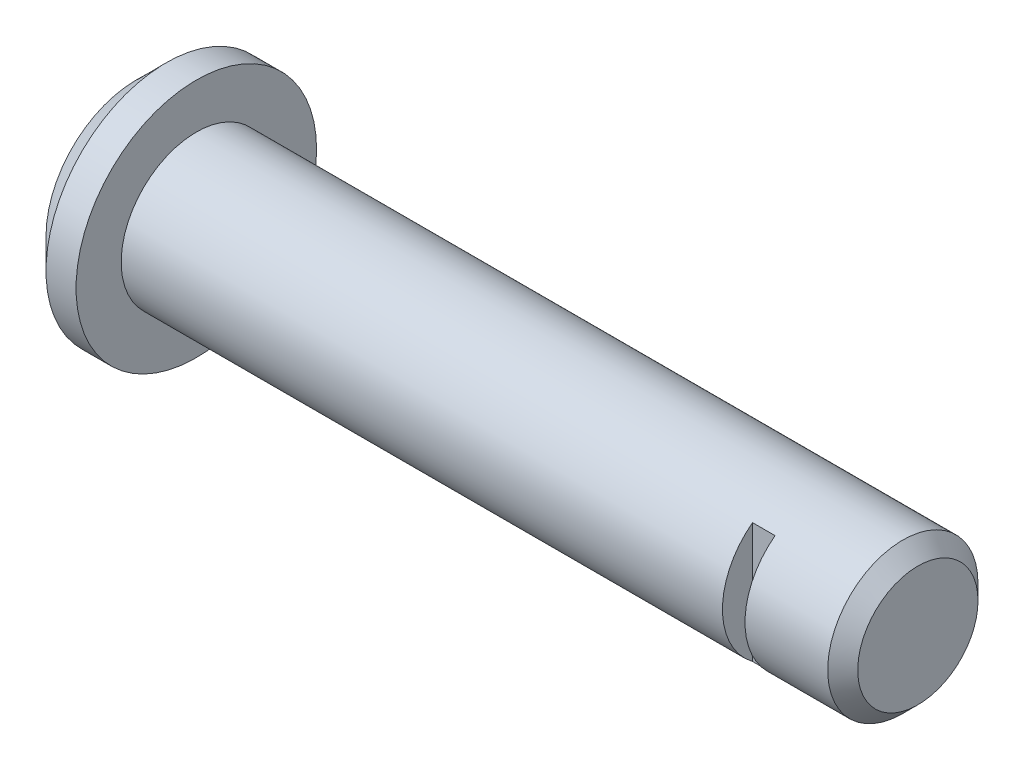
ISO-10303-21;
HEADER;
FILE_DESCRIPTION(('STEP AP214'),'2;1');
FILE_NAME('part.step','',(''),(''),'','','');
FILE_SCHEMA(('AUTOMOTIVE_DESIGN { 1 0 10303 214 1 1 1 1 }'));
ENDSEC;
DATA;
#1=APPLICATION_CONTEXT('core data for automotive mechanical design processes');
#2=APPLICATION_PROTOCOL_DEFINITION('international standard','automotive_design',2000,#1);
#3=PRODUCT_CONTEXT('',#1,'mechanical');
#4=PRODUCT('Part','Part','',(#3));
#5=PRODUCT_RELATED_PRODUCT_CATEGORY('part','',(#4));
#6=PRODUCT_DEFINITION_FORMATION('','',#4);
#7=PRODUCT_DEFINITION_CONTEXT('part definition',#1,'design');
#8=PRODUCT_DEFINITION('design','',#6,#7);
#9=PRODUCT_DEFINITION_SHAPE('','',#8);
#10=(LENGTH_UNIT() NAMED_UNIT(*) SI_UNIT(.MILLI.,.METRE.));
#11=(NAMED_UNIT(*) PLANE_ANGLE_UNIT() SI_UNIT($,.RADIAN.));
#12=(NAMED_UNIT(*) SI_UNIT($,.STERADIAN.) SOLID_ANGLE_UNIT());
#13=UNCERTAINTY_MEASURE_WITH_UNIT(LENGTH_MEASURE(1.E-05),#10,'distance_accuracy_value','');
#14=(GEOMETRIC_REPRESENTATION_CONTEXT(3) GLOBAL_UNCERTAINTY_ASSIGNED_CONTEXT((#13)) GLOBAL_UNIT_ASSIGNED_CONTEXT((#10,
#11,#12)) REPRESENTATION_CONTEXT('',''));
#15=CARTESIAN_POINT('',(0.,0.,0.));
#16=DIRECTION('',(0.,0.,1.));
#17=DIRECTION('',(1.,0.,0.));
#18=AXIS2_PLACEMENT_3D('',#15,#16,#17);
#19=CARTESIAN_POINT('',(0.,0.,0.));
#20=DIRECTION('',(-1.,0.,0.));
#21=DIRECTION('',(0.,0.,1.));
#22=AXIS2_PLACEMENT_3D('',#19,#20,#21);
#23=PLANE('',#22);
#24=CARTESIAN_POINT('',(0.,0.,-9.99999999999999));
#25=DIRECTION('',(1.,0.,0.));
#26=DIRECTION('',(0.,0.,-1.));
#27=AXIS2_PLACEMENT_3D('',#24,#25,#26);
#28=CIRCLE('',#27,9.99999999999999);
#29=CARTESIAN_POINT('',(0.,0.,-20.));
#30=VERTEX_POINT('',#29);
#31=EDGE_CURVE('E104',#30,#30,#28,.T.);
#32=ORIENTED_EDGE('',*,*,#31,.F.);
#33=EDGE_LOOP('',(#32));
#34=FACE_BOUND('',#33,.T.);
#35=CARTESIAN_POINT('',(0.,0.,-9.99999999999999));
#36=DIRECTION('',(1.,0.,0.));
#37=DIRECTION('',(0.,0.,-1.));
#38=AXIS2_PLACEMENT_3D('',#35,#36,#37);
#39=CIRCLE('',#38,16.);
#40=CARTESIAN_POINT('',(0.,0.,-26.));
#41=VERTEX_POINT('',#40);
#42=EDGE_CURVE('E70',#41,#41,#39,.T.);
#43=ORIENTED_EDGE('',*,*,#42,.T.);
#44=EDGE_LOOP('',(#43));
#45=FACE_BOUND('',#44,.T.);
#46=ADVANCED_FACE('F38',(#34,#45),#23,.F.);
#47=CARTESIAN_POINT('',(67.877257864528,0.,-10.));
#48=DIRECTION('',(1.,0.,0.));
#49=DIRECTION('',(0.,0.,-1.));
#50=AXIS2_PLACEMENT_3D('',#47,#48,#49);
#51=CYLINDRICAL_SURFACE('',#50,16.);
#52=ORIENTED_EDGE('',*,*,#42,.F.);
#53=EDGE_LOOP('',(#52));
#54=FACE_BOUND('',#53,.T.);
#55=CARTESIAN_POINT('',(-4.,0.,-9.99999999999999));
#56=DIRECTION('',(1.,0.,0.));
#57=DIRECTION('',(0.,0.,-1.));
#58=AXIS2_PLACEMENT_3D('',#55,#56,#57);
#59=CIRCLE('',#58,16.);
#60=CARTESIAN_POINT('',(-4.00000000000001,0.,-26.));
#61=VERTEX_POINT('',#60);
#62=EDGE_CURVE('E88',#61,#61,#59,.T.);
#63=ORIENTED_EDGE('',*,*,#62,.T.);
#64=EDGE_LOOP('',(#63));
#65=FACE_BOUND('',#64,.T.);
#66=ADVANCED_FACE('F121',(#54,#65),#51,.T.);
#67=CARTESIAN_POINT('',(-7.99999999999999,0.,-9.99999999999999));
#68=DIRECTION('',(1.,0.,0.));
#69=DIRECTION('',(0.,0.,-1.));
#70=AXIS2_PLACEMENT_3D('',#67,#68,#69);
#71=CONICAL_SURFACE('',#70,12.,0.785398163397448);
#72=ORIENTED_EDGE('',*,*,#62,.F.);
#73=EDGE_LOOP('',(#72));
#74=FACE_BOUND('',#73,.T.);
#75=CARTESIAN_POINT('',(-7.99999999999999,0.,-9.99999999999999));
#76=DIRECTION('',(1.,0.,0.));
#77=DIRECTION('',(0.,0.,-1.));
#78=AXIS2_PLACEMENT_3D('',#75,#76,#77);
#79=CIRCLE('',#78,12.);
#80=CARTESIAN_POINT('',(-7.99999999999999,0.,-22.));
#81=VERTEX_POINT('',#80);
#82=EDGE_CURVE('E92',#81,#81,#79,.T.);
#83=ORIENTED_EDGE('',*,*,#82,.T.);
#84=EDGE_LOOP('',(#83));
#85=FACE_BOUND('',#84,.T.);
#86=ADVANCED_FACE('F126',(#74,#85),#71,.T.);
#87=CARTESIAN_POINT('',(-8.,0.,2.00000000000002));
#88=DIRECTION('',(1.,0.,0.));
#89=DIRECTION('',(0.,0.,-1.));
#90=AXIS2_PLACEMENT_3D('',#87,#88,#89);
#91=PLANE('',#90);
#92=ORIENTED_EDGE('',*,*,#82,.F.);
#93=EDGE_LOOP('',(#92));
#94=FACE_BOUND('',#93,.T.);
#95=ADVANCED_FACE('F136',(#94),#91,.F.);
#96=CARTESIAN_POINT('',(96.,0.,-2.));
#97=DIRECTION('',(-1.,0.,0.));
#98=DIRECTION('',(0.,0.,1.));
#99=AXIS2_PLACEMENT_3D('',#96,#97,#98);
#100=PLANE('',#99);
#101=CARTESIAN_POINT('',(96.,0.,-10.));
#102=DIRECTION('',(1.,0.,0.));
#103=DIRECTION('',(0.,0.,-1.));
#104=AXIS2_PLACEMENT_3D('',#101,#102,#103);
#105=CIRCLE('',#104,8.00000000000001);
#106=CARTESIAN_POINT('',(96.,0.,-18.));
#107=VERTEX_POINT('',#106);
#108=EDGE_CURVE('E96',#107,#107,#105,.T.);
#109=ORIENTED_EDGE('',*,*,#108,.T.);
#110=EDGE_LOOP('',(#109));
#111=FACE_BOUND('',#110,.T.);
#112=ADVANCED_FACE('F141',(#111),#100,.F.);
#113=CARTESIAN_POINT('',(94.,0.,-10.));
#114=DIRECTION('',(-1.,0.,0.));
#115=DIRECTION('',(0.,0.,1.));
#116=AXIS2_PLACEMENT_3D('',#113,#114,#115);
#117=CONICAL_SURFACE('',#116,10.,0.785398163397447);
#118=ORIENTED_EDGE('',*,*,#108,.F.);
#119=EDGE_LOOP('',(#118));
#120=FACE_BOUND('',#119,.T.);
#121=CARTESIAN_POINT('',(94.,0.,-10.));
#122=DIRECTION('',(1.,0.,0.));
#123=DIRECTION('',(0.,0.,-1.));
#124=AXIS2_PLACEMENT_3D('',#121,#122,#123);
#125=CIRCLE('',#124,10.);
#126=CARTESIAN_POINT('',(94.,0.,-20.));
#127=VERTEX_POINT('',#126);
#128=EDGE_CURVE('E100',#127,#127,#125,.T.);
#129=ORIENTED_EDGE('',*,*,#128,.T.);
#130=EDGE_LOOP('',(#129));
#131=FACE_BOUND('',#130,.T.);
#132=ADVANCED_FACE('F118',(#120,#131),#117,.T.);
#133=CARTESIAN_POINT('',(67.877257864528,0.,-10.));
#134=DIRECTION('',(1.,0.,0.));
#135=DIRECTION('',(0.,0.,-1.));
#136=AXIS2_PLACEMENT_3D('',#133,#134,#135);
#137=CYLINDRICAL_SURFACE('',#136,10.);
#138=CARTESIAN_POINT('',(80.,0.,-10.));
#139=DIRECTION('',(-1.,0.,0.));
#140=DIRECTION('',(0.,0.,1.));
#141=AXIS2_PLACEMENT_3D('',#138,#139,#140);
#142=CIRCLE('',#141,10.);
#143=CARTESIAN_POINT('',(80.,-7.99999999999995,-4.));
#144=VERTEX_POINT('',#143);
#145=CARTESIAN_POINT('',(80.,8.00000000000006,-4.));
#146=VERTEX_POINT('',#145);
#147=EDGE_CURVE('E11',#144,#146,#142,.T.);
#148=ORIENTED_EDGE('',*,*,#147,.T.);
#149=DIRECTION('',(1.,0.,0.));
#150=VECTOR('',#149,1.);
#151=CARTESIAN_POINT('',(67.877257864528,8.,-4.));
#152=LINE('',#151,#150);
#153=CARTESIAN_POINT('',(83.,7.99999999999999,-4.));
#154=VERTEX_POINT('',#153);
#155=EDGE_CURVE('E46',#146,#154,#152,.T.);
#156=ORIENTED_EDGE('',*,*,#155,.T.);
#157=CARTESIAN_POINT('',(83.,0.,-10.));
#158=DIRECTION('',(1.,0.,0.));
#159=DIRECTION('',(0.,0.,-1.));
#160=AXIS2_PLACEMENT_3D('',#157,#158,#159);
#161=CIRCLE('',#160,10.);
#162=CARTESIAN_POINT('',(83.,-7.99999999999999,-4.));
#163=VERTEX_POINT('',#162);
#164=EDGE_CURVE('E63',#154,#163,#161,.T.);
#165=ORIENTED_EDGE('',*,*,#164,.T.);
#166=DIRECTION('',(1.,0.,0.));
#167=VECTOR('',#166,1.);
#168=CARTESIAN_POINT('',(67.877257864528,-8.,-4.));
#169=LINE('',#168,#167);
#170=EDGE_CURVE('E69',#163,#144,#169,.F.);
#171=ORIENTED_EDGE('',*,*,#170,.T.);
#172=EDGE_LOOP('',(#148,#156,#165,#171));
#173=FACE_BOUND('',#172,.T.);
#174=ORIENTED_EDGE('',*,*,#128,.F.);
#175=EDGE_LOOP('',(#174));
#176=FACE_BOUND('',#175,.T.);
#177=ORIENTED_EDGE('',*,*,#31,.T.);
#178=EDGE_LOOP('',(#177));
#179=FACE_BOUND('',#178,.T.);
#180=ADVANCED_FACE('F78',(#173,#176,#179),#137,.T.);
#181=CARTESIAN_POINT('',(80.,231.774468787578,0.));
#182=DIRECTION('',(-1.,0.,0.));
#183=DIRECTION('',(0.,0.,1.));
#184=AXIS2_PLACEMENT_3D('',#181,#182,#183);
#185=PLANE('',#184);
#186=DIRECTION('',(0.,-1.,0.));
#187=VECTOR('',#186,1.);
#188=CARTESIAN_POINT('',(80.,231.774468787578,-4.));
#189=LINE('',#188,#187);
#190=EDGE_CURVE('E76',#146,#144,#189,.T.);
#191=ORIENTED_EDGE('',*,*,#190,.F.);
#192=ORIENTED_EDGE('',*,*,#147,.F.);
#193=EDGE_LOOP('',(#191,#192));
#194=FACE_BOUND('',#193,.T.);
#195=ADVANCED_FACE('F110',(#194),#185,.F.);
#196=CARTESIAN_POINT('',(80.,231.774468787578,-4.));
#197=DIRECTION('',(0.,0.,-1.));
#198=DIRECTION('',(-1.,0.,0.));
#199=AXIS2_PLACEMENT_3D('',#196,#197,#198);
#200=PLANE('',#199);
#201=ORIENTED_EDGE('',*,*,#155,.F.);
#202=ORIENTED_EDGE('',*,*,#190,.T.);
#203=ORIENTED_EDGE('',*,*,#170,.F.);
#204=DIRECTION('',(0.,-1.,0.));
#205=VECTOR('',#204,1.);
#206=CARTESIAN_POINT('',(83.,231.774468787578,-4.));
#207=LINE('',#206,#205);
#208=EDGE_CURVE('E52',#154,#163,#207,.T.);
#209=ORIENTED_EDGE('',*,*,#208,.F.);
#210=EDGE_LOOP('',(#201,#202,#203,#209));
#211=FACE_BOUND('',#210,.T.);
#212=ADVANCED_FACE('F74',(#211),#200,.F.);
#213=CARTESIAN_POINT('',(83.,231.774468787578,-4.));
#214=DIRECTION('',(1.,0.,0.));
#215=DIRECTION('',(0.,0.,-1.));
#216=AXIS2_PLACEMENT_3D('',#213,#214,#215);
#217=PLANE('',#216);
#218=ORIENTED_EDGE('',*,*,#164,.F.);
#219=ORIENTED_EDGE('',*,*,#208,.T.);
#220=EDGE_LOOP('',(#218,#219));
#221=FACE_BOUND('',#220,.T.);
#222=ADVANCED_FACE('F64',(#221),#217,.F.);
#223=CLOSED_SHELL('',(#46,#66,#86,#95,#112,#132,#180,#195,#212,#222));
#224=MANIFOLD_SOLID_BREP('B2',#223);
#225=ADVANCED_BREP_SHAPE_REPRESENTATION('',(#18,#224),#14);
#226=SHAPE_DEFINITION_REPRESENTATION(#9,#225);
ENDSEC;
END-ISO-10303-21;
